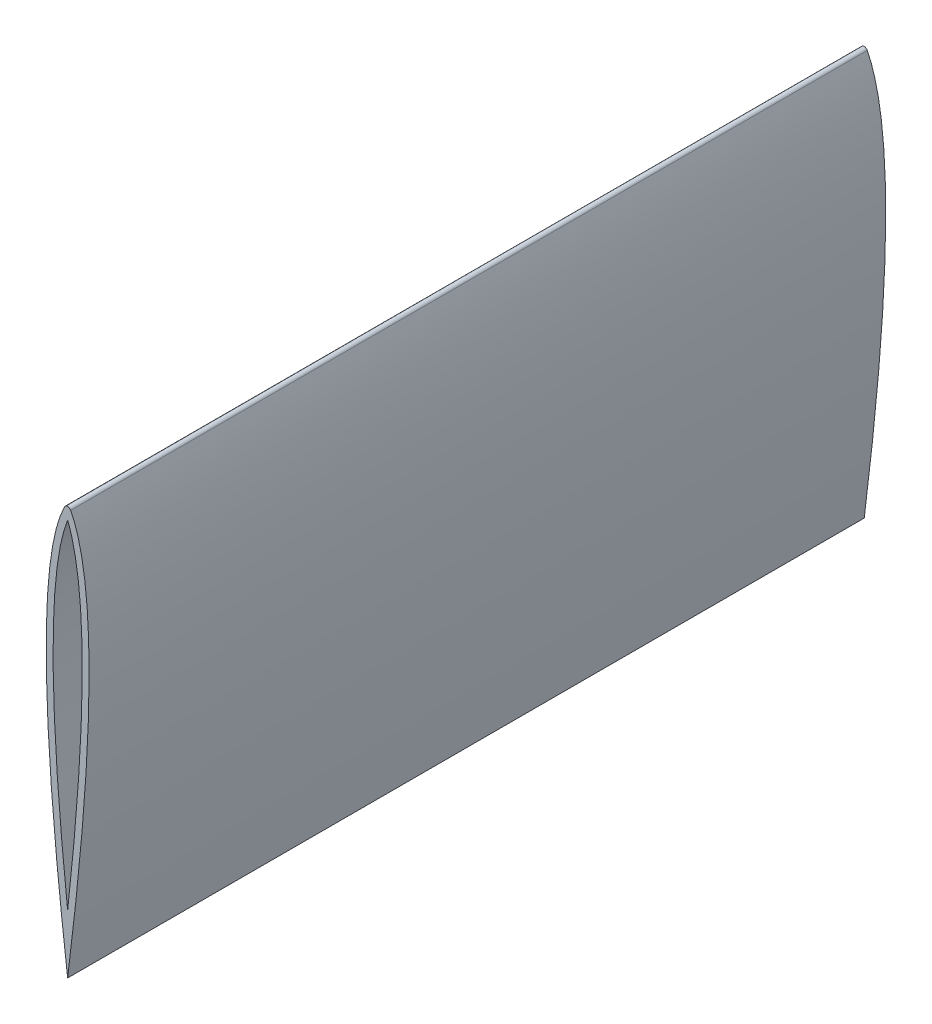
ISO-10303-21;
HEADER;
FILE_DESCRIPTION(('STEP AP214'),'2;1');
FILE_NAME('part.step','',(''),(''),'','','');
FILE_SCHEMA(('AUTOMOTIVE_DESIGN { 1 0 10303 214 1 1 1 1 }'));
ENDSEC;
DATA;
#1=APPLICATION_CONTEXT('core data for automotive mechanical design processes');
#2=APPLICATION_PROTOCOL_DEFINITION('international standard','automotive_design',2000,#1);
#3=PRODUCT_CONTEXT('',#1,'mechanical');
#4=PRODUCT('Part','Part','',(#3));
#5=PRODUCT_RELATED_PRODUCT_CATEGORY('part','',(#4));
#6=PRODUCT_DEFINITION_FORMATION('','',#4);
#7=PRODUCT_DEFINITION_CONTEXT('part definition',#1,'design');
#8=PRODUCT_DEFINITION('design','',#6,#7);
#9=PRODUCT_DEFINITION_SHAPE('','',#8);
#10=(LENGTH_UNIT() NAMED_UNIT(*) SI_UNIT(.MILLI.,.METRE.));
#11=(NAMED_UNIT(*) PLANE_ANGLE_UNIT() SI_UNIT($,.RADIAN.));
#12=(NAMED_UNIT(*) SI_UNIT($,.STERADIAN.) SOLID_ANGLE_UNIT());
#13=UNCERTAINTY_MEASURE_WITH_UNIT(LENGTH_MEASURE(1.E-05),#10,'distance_accuracy_value','');
#14=(GEOMETRIC_REPRESENTATION_CONTEXT(3) GLOBAL_UNCERTAINTY_ASSIGNED_CONTEXT((#13)) GLOBAL_UNIT_ASSIGNED_CONTEXT((#10,
#11,#12)) REPRESENTATION_CONTEXT('',''));
#15=CARTESIAN_POINT('',(0.,0.,0.));
#16=DIRECTION('',(0.,0.,1.));
#17=DIRECTION('',(1.,0.,0.));
#18=AXIS2_PLACEMENT_3D('',#15,#16,#17);
#19=CARTESIAN_POINT('',(15.853163035224,45.1076472609895,294.64));
#20=DIRECTION('',(0.,0.,1.));
#21=DIRECTION('',(1.,0.,0.));
#22=AXIS2_PLACEMENT_3D('',#19,#20,#21);
#23=PLANE('',#22);
#24=CARTESIAN_POINT('',(0.,-152.4,294.64));
#25=CARTESIAN_POINT('',(30.5724401232739,92.2411110099885,294.64));
#26=CARTESIAN_POINT('',(2.26777189434819,148.348367023981,294.64));
#27=B_SPLINE_CURVE_WITH_KNOTS('',2,(#24,#25,#26),.UNSPECIFIED.,.F.,.F.,(3,3),(0.,1.),.UNSPECIFIED.);
#28=CARTESIAN_POINT('',(0.,-152.4,294.64));
#29=VERTEX_POINT('',#28);
#30=CARTESIAN_POINT('',(2.26777189434819,148.348367023981,294.64));
#31=VERTEX_POINT('',#30);
#32=EDGE_CURVE('E145',#29,#31,#27,.T.);
#33=ORIENTED_EDGE('',*,*,#32,.T.);
#34=CARTESIAN_POINT('',(0.,147.204334404164,294.64));
#35=DIRECTION('',(0.,0.,1.));
#36=DIRECTION('',(-1.,0.,0.));
#37=AXIS2_PLACEMENT_3D('',#34,#35,#36);
#38=CIRCLE('',#37,2.53999999999999);
#39=CARTESIAN_POINT('',(-2.26777189434819,148.348367023981,294.64));
#40=VERTEX_POINT('',#39);
#41=EDGE_CURVE('E127',#31,#40,#38,.T.);
#42=ORIENTED_EDGE('',*,*,#41,.T.);
#43=CARTESIAN_POINT('',(-2.26777189434819,148.348367023981,294.64));
#44=CARTESIAN_POINT('',(-30.5724401232739,92.2411110099885,294.64));
#45=CARTESIAN_POINT('',(0.,-152.4,294.64));
#46=B_SPLINE_CURVE_WITH_KNOTS('',2,(#43,#44,#45),.UNSPECIFIED.,.F.,.F.,(3,3),(0.,1.),.UNSPECIFIED.);
#47=EDGE_CURVE('E120',#40,#29,#46,.T.);
#48=ORIENTED_EDGE('',*,*,#47,.T.);
#49=EDGE_LOOP('',(#33,#42,#48));
#50=FACE_BOUND('',#49,.T.);
#51=CARTESIAN_POINT('',(0.,-109.125318419714,294.64));
#52=CARTESIAN_POINT('',(8.16373796542807,-35.5088464124318,294.64));
#53=CARTESIAN_POINT('',(11.1456655969047,45.0401668444738,294.64));
#54=CARTESIAN_POINT('',(10.2425746417,81.4333456049166,294.64));
#55=CARTESIAN_POINT('',(8.16937817155045,106.055563129854,294.64));
#56=CARTESIAN_POINT('',(3.91848207404641,131.156065716608,294.64));
#57=CARTESIAN_POINT('',(0.,140.978035644634,294.64));
#58=B_SPLINE_CURVE_WITH_KNOTS('',2,(#51,#52,#53,#54,#55,#56,#57),.UNSPECIFIED.,.F.,.F.,(3,1,1,1,
1,3),(0.0455268147428226,0.369534324590266,0.531538079513987,0.639540582796468,
0.747543086078949,0.909546841002671),.UNSPECIFIED.);
#59=CARTESIAN_POINT('',(0.,-109.125318419714,294.64));
#60=VERTEX_POINT('',#59);
#61=CARTESIAN_POINT('',(0.,140.978035644634,294.64));
#62=VERTEX_POINT('',#61);
#63=EDGE_CURVE('E81',#60,#62,#58,.T.);
#64=ORIENTED_EDGE('',*,*,#63,.F.);
#65=CARTESIAN_POINT('',(0.,140.978035644635,294.64));
#66=CARTESIAN_POINT('',(-3.91848207404643,131.156065716608,294.64));
#67=CARTESIAN_POINT('',(-8.16937817155045,106.055563129853,294.64));
#68=CARTESIAN_POINT('',(-10.2425746417,81.4333456049166,294.64));
#69=CARTESIAN_POINT('',(-11.1456655969047,45.0401668444737,294.64));
#70=CARTESIAN_POINT('',(-8.16373796542806,-35.5088464124318,294.64));
#71=CARTESIAN_POINT('',(0.,-109.125318419714,294.64));
#72=B_SPLINE_CURVE_WITH_KNOTS('',2,(#65,#66,#67,#68,#69,#70,#71),.UNSPECIFIED.,.F.,.F.,(3,1,1,1,
1,3),(0.0455268147428228,0.207530569666544,0.315533072949025,0.423535576231506,
0.585539331155228,0.909546841002671),.UNSPECIFIED.);
#73=EDGE_CURVE('E87',#62,#60,#72,.T.);
#74=ORIENTED_EDGE('',*,*,#73,.F.);
#75=EDGE_LOOP('',(#64,#74));
#76=FACE_BOUND('',#75,.T.);
#77=ADVANCED_FACE('F34',(#50,#76),#23,.T.);
#78=CARTESIAN_POINT('',(15.853163035224,45.1076472609895,-294.64));
#79=DIRECTION('',(0.,0.,1.));
#80=DIRECTION('',(1.,0.,0.));
#81=AXIS2_PLACEMENT_3D('',#78,#79,#80);
#82=PLANE('',#81);
#83=CARTESIAN_POINT('',(0.,-152.4,-294.64));
#84=CARTESIAN_POINT('',(30.5724401232739,92.2411110099885,-294.64));
#85=CARTESIAN_POINT('',(2.26777189434819,148.348367023981,-294.64));
#86=B_SPLINE_CURVE_WITH_KNOTS('',2,(#83,#84,#85),.UNSPECIFIED.,.F.,.F.,(3,3),(0.,1.),.UNSPECIFIED.);
#87=CARTESIAN_POINT('',(0.,-152.4,-294.64));
#88=VERTEX_POINT('',#87);
#89=CARTESIAN_POINT('',(2.26777189434819,148.348367023981,-294.64));
#90=VERTEX_POINT('',#89);
#91=EDGE_CURVE('E128',#88,#90,#86,.T.);
#92=ORIENTED_EDGE('',*,*,#91,.F.);
#93=CARTESIAN_POINT('',(-2.26777189434819,148.348367023981,-294.64));
#94=CARTESIAN_POINT('',(-30.5724401232739,92.2411110099885,-294.64));
#95=CARTESIAN_POINT('',(0.,-152.4,-294.64));
#96=B_SPLINE_CURVE_WITH_KNOTS('',2,(#93,#94,#95),.UNSPECIFIED.,.F.,.F.,(3,3),(0.,1.),.UNSPECIFIED.);
#97=CARTESIAN_POINT('',(-2.26777189434819,148.348367023981,-294.64));
#98=VERTEX_POINT('',#97);
#99=EDGE_CURVE('E141',#98,#88,#96,.T.);
#100=ORIENTED_EDGE('',*,*,#99,.F.);
#101=CARTESIAN_POINT('',(0.,147.204334404164,-294.64));
#102=DIRECTION('',(0.,0.,1.));
#103=DIRECTION('',(-1.,0.,0.));
#104=AXIS2_PLACEMENT_3D('',#101,#102,#103);
#105=CIRCLE('',#104,2.53999999999999);
#106=EDGE_CURVE('E136',#90,#98,#105,.T.);
#107=ORIENTED_EDGE('',*,*,#106,.F.);
#108=EDGE_LOOP('',(#92,#100,#107));
#109=FACE_BOUND('',#108,.T.);
#110=CARTESIAN_POINT('',(0.,140.978035644635,-294.64));
#111=CARTESIAN_POINT('',(-3.91848207404643,131.156065716608,-294.64));
#112=CARTESIAN_POINT('',(-8.16937817155045,106.055563129853,-294.64));
#113=CARTESIAN_POINT('',(-10.2425746417,81.4333456049166,-294.64));
#114=CARTESIAN_POINT('',(-11.1456655969047,45.0401668444737,-294.64));
#115=CARTESIAN_POINT('',(-8.16373796542806,-35.5088464124318,-294.64));
#116=CARTESIAN_POINT('',(0.,-109.125318419714,-294.64));
#117=B_SPLINE_CURVE_WITH_KNOTS('',2,(#110,#111,#112,#113,#114,#115,#116),.UNSPECIFIED.,.F.,.F.,
(3,1,1,1,1,3),(0.0455268147428228,0.207530569666544,0.315533072949025,0.423535576231506,
0.585539331155228,0.909546841002671),.UNSPECIFIED.);
#118=CARTESIAN_POINT('',(0.,140.978035644634,-294.64));
#119=VERTEX_POINT('',#118);
#120=CARTESIAN_POINT('',(0.,-109.125318419714,-294.64));
#121=VERTEX_POINT('',#120);
#122=EDGE_CURVE('E57',#119,#121,#117,.T.);
#123=ORIENTED_EDGE('',*,*,#122,.T.);
#124=CARTESIAN_POINT('',(0.,-109.125318419714,-294.64));
#125=CARTESIAN_POINT('',(8.16373796542807,-35.5088464124318,-294.64));
#126=CARTESIAN_POINT('',(11.1456655969047,45.0401668444738,-294.64));
#127=CARTESIAN_POINT('',(10.2425746417,81.4333456049166,-294.64));
#128=CARTESIAN_POINT('',(8.16937817155045,106.055563129854,-294.64));
#129=CARTESIAN_POINT('',(3.91848207404641,131.156065716608,-294.64));
#130=CARTESIAN_POINT('',(0.,140.978035644634,-294.64));
#131=B_SPLINE_CURVE_WITH_KNOTS('',2,(#124,#125,#126,#127,#128,#129,#130),.UNSPECIFIED.,.F.,.F.,
(3,1,1,1,1,3),(0.0455268147428226,0.369534324590266,0.531538079513987,0.639540582796468,
0.747543086078949,0.909546841002671),.UNSPECIFIED.);
#132=EDGE_CURVE('E91',#121,#119,#131,.T.);
#133=ORIENTED_EDGE('',*,*,#132,.T.);
#134=EDGE_LOOP('',(#123,#133));
#135=FACE_BOUND('',#134,.T.);
#136=ADVANCED_FACE('F111',(#109,#135),#82,.F.);
#137=DIRECTION('',(0.,0.,-1.));
#138=VECTOR('',#137,1.);
#139=SURFACE_OF_LINEAR_EXTRUSION('',#27,#138);
#140=ORIENTED_EDGE('',*,*,#91,.T.);
#141=DIRECTION('',(0.,0.,-1.));
#142=VECTOR('',#141,1.);
#143=CARTESIAN_POINT('',(2.26777189434819,148.348367023981,294.64));
#144=LINE('',#143,#142);
#145=EDGE_CURVE('E11',#31,#90,#144,.T.);
#146=ORIENTED_EDGE('',*,*,#145,.F.);
#147=ORIENTED_EDGE('',*,*,#32,.F.);
#148=DIRECTION('',(0.,0.,-1.));
#149=VECTOR('',#148,1.);
#150=CARTESIAN_POINT('',(0.,-152.4,294.64));
#151=LINE('',#150,#149);
#152=EDGE_CURVE('E126',#29,#88,#151,.T.);
#153=ORIENTED_EDGE('',*,*,#152,.T.);
#154=EDGE_LOOP('',(#140,#146,#147,#153));
#155=FACE_BOUND('',#154,.T.);
#156=ADVANCED_FACE('F36',(#155),#139,.F.);
#157=CARTESIAN_POINT('',(0.,147.204334404164,294.64));
#158=DIRECTION('',(0.,0.,-1.));
#159=DIRECTION('',(-1.,0.,0.));
#160=AXIS2_PLACEMENT_3D('',#157,#158,#159);
#161=CYLINDRICAL_SURFACE('',#160,2.53999999999999);
#162=ORIENTED_EDGE('',*,*,#106,.T.);
#163=DIRECTION('',(0.,0.,-1.));
#164=VECTOR('',#163,1.);
#165=CARTESIAN_POINT('',(-2.26777189434819,148.348367023981,294.64));
#166=LINE('',#165,#164);
#167=EDGE_CURVE('E43',#40,#98,#166,.T.);
#168=ORIENTED_EDGE('',*,*,#167,.F.);
#169=ORIENTED_EDGE('',*,*,#41,.F.);
#170=ORIENTED_EDGE('',*,*,#145,.T.);
#171=EDGE_LOOP('',(#162,#168,#169,#170));
#172=FACE_BOUND('',#171,.T.);
#173=ADVANCED_FACE('F118',(#172),#161,.T.);
#174=DIRECTION('',(0.,0.,-1.));
#175=VECTOR('',#174,1.);
#176=SURFACE_OF_LINEAR_EXTRUSION('',#46,#175);
#177=ORIENTED_EDGE('',*,*,#99,.T.);
#178=ORIENTED_EDGE('',*,*,#152,.F.);
#179=ORIENTED_EDGE('',*,*,#47,.F.);
#180=ORIENTED_EDGE('',*,*,#167,.T.);
#181=EDGE_LOOP('',(#177,#178,#179,#180));
#182=FACE_BOUND('',#181,.T.);
#183=ADVANCED_FACE('F108',(#182),#176,.F.);
#184=DIRECTION('',(0.,0.,-1.));
#185=VECTOR('',#184,1.);
#186=SURFACE_OF_LINEAR_EXTRUSION('',#72,#185);
#187=ORIENTED_EDGE('',*,*,#122,.F.);
#188=DIRECTION('',(0.,0.,-1.));
#189=VECTOR('',#188,1.);
#190=CARTESIAN_POINT('',(0.,140.978035644634,294.64));
#191=LINE('',#190,#189);
#192=EDGE_CURVE('E83',#62,#119,#191,.T.);
#193=ORIENTED_EDGE('',*,*,#192,.F.);
#194=ORIENTED_EDGE('',*,*,#73,.T.);
#195=DIRECTION('',(0.,0.,-1.));
#196=VECTOR('',#195,1.);
#197=CARTESIAN_POINT('',(0.,-109.125318419714,294.64));
#198=LINE('',#197,#196);
#199=EDGE_CURVE('E50',#60,#121,#198,.T.);
#200=ORIENTED_EDGE('',*,*,#199,.T.);
#201=EDGE_LOOP('',(#187,#193,#194,#200));
#202=FACE_BOUND('',#201,.T.);
#203=ADVANCED_FACE('F89',(#202),#186,.T.);
#204=DIRECTION('',(0.,0.,-1.));
#205=VECTOR('',#204,1.);
#206=SURFACE_OF_LINEAR_EXTRUSION('',#58,#205);
#207=ORIENTED_EDGE('',*,*,#132,.F.);
#208=ORIENTED_EDGE('',*,*,#199,.F.);
#209=ORIENTED_EDGE('',*,*,#63,.T.);
#210=ORIENTED_EDGE('',*,*,#192,.T.);
#211=EDGE_LOOP('',(#207,#208,#209,#210));
#212=FACE_BOUND('',#211,.T.);
#213=ADVANCED_FACE('F82',(#212),#206,.T.);
#214=CLOSED_SHELL('',(#77,#136,#156,#173,#183,#203,#213));
#215=MANIFOLD_SOLID_BREP('B2',#214);
#216=ADVANCED_BREP_SHAPE_REPRESENTATION('',(#18,#215),#14);
#217=SHAPE_DEFINITION_REPRESENTATION(#9,#216);
ENDSEC;
END-ISO-10303-21;
